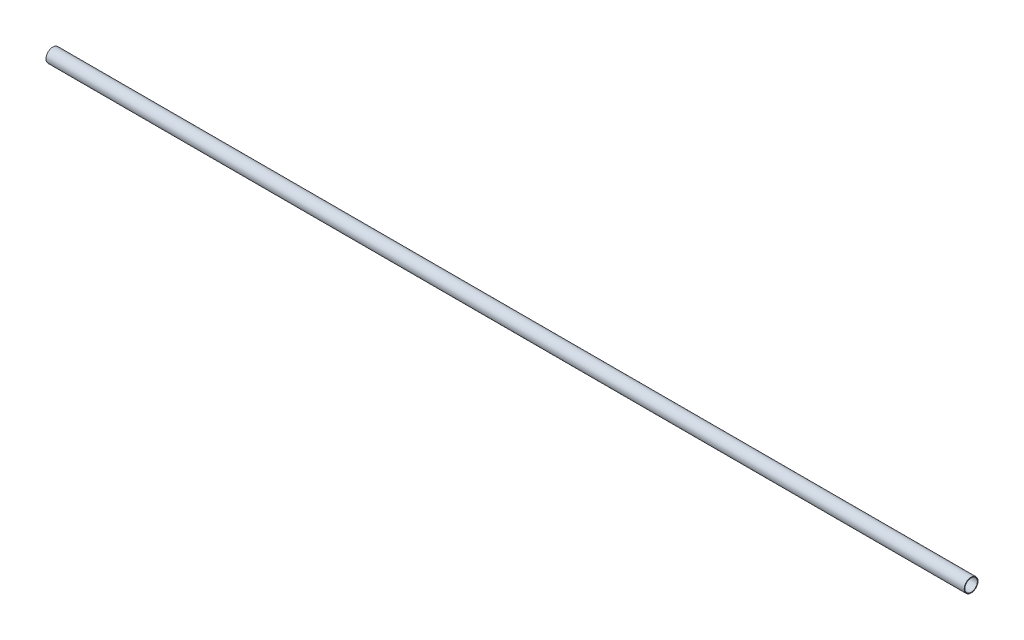
ISO-10303-21;
HEADER;
FILE_DESCRIPTION(('STEP AP214'),'2;1');
FILE_NAME('part.step','',(''),(''),'','','');
FILE_SCHEMA(('AUTOMOTIVE_DESIGN { 1 0 10303 214 1 1 1 1 }'));
ENDSEC;
DATA;
#1=APPLICATION_CONTEXT('core data for automotive mechanical design processes');
#2=APPLICATION_PROTOCOL_DEFINITION('international standard','automotive_design',2000,#1);
#3=PRODUCT_CONTEXT('',#1,'mechanical');
#4=PRODUCT('Part','Part','',(#3));
#5=PRODUCT_RELATED_PRODUCT_CATEGORY('part','',(#4));
#6=PRODUCT_DEFINITION_FORMATION('','',#4);
#7=PRODUCT_DEFINITION_CONTEXT('part definition',#1,'design');
#8=PRODUCT_DEFINITION('design','',#6,#7);
#9=PRODUCT_DEFINITION_SHAPE('','',#8);
#10=(LENGTH_UNIT() NAMED_UNIT(*) SI_UNIT(.MILLI.,.METRE.));
#11=(NAMED_UNIT(*) PLANE_ANGLE_UNIT() SI_UNIT($,.RADIAN.));
#12=(NAMED_UNIT(*) SI_UNIT($,.STERADIAN.) SOLID_ANGLE_UNIT());
#13=UNCERTAINTY_MEASURE_WITH_UNIT(LENGTH_MEASURE(1.E-05),#10,'distance_accuracy_value','');
#14=(GEOMETRIC_REPRESENTATION_CONTEXT(3) GLOBAL_UNCERTAINTY_ASSIGNED_CONTEXT((#13)) GLOBAL_UNIT_ASSIGNED_CONTEXT((#10,
#11,#12)) REPRESENTATION_CONTEXT('',''));
#15=CARTESIAN_POINT('',(0.,0.,0.));
#16=DIRECTION('',(0.,0.,1.));
#17=DIRECTION('',(1.,0.,0.));
#18=AXIS2_PLACEMENT_3D('',#15,#16,#17);
#19=CARTESIAN_POINT('',(0.,0.,0.));
#20=DIRECTION('',(1.,0.,0.));
#21=DIRECTION('',(0.,0.,-1.));
#22=AXIS2_PLACEMENT_3D('',#19,#20,#21);
#23=CYLINDRICAL_SURFACE('',#22,33.9);
#24=CARTESIAN_POINT('',(0.,0.,0.));
#25=DIRECTION('',(1.,0.,0.));
#26=DIRECTION('',(0.,0.,-1.));
#27=AXIS2_PLACEMENT_3D('',#24,#25,#26);
#28=CIRCLE('',#27,33.9);
#29=CARTESIAN_POINT('',(0.,0.,-33.9));
#30=VERTEX_POINT('',#29);
#31=EDGE_CURVE('E16',#30,#30,#28,.T.);
#32=ORIENTED_EDGE('',*,*,#31,.F.);
#33=EDGE_LOOP('',(#32));
#34=FACE_BOUND('',#33,.T.);
#35=CARTESIAN_POINT('',(5000.,0.,0.));
#36=DIRECTION('',(1.,0.,0.));
#37=DIRECTION('',(0.,0.,-1.));
#38=AXIS2_PLACEMENT_3D('',#35,#36,#37);
#39=CIRCLE('',#38,33.9);
#40=CARTESIAN_POINT('',(5000.,0.,-33.9));
#41=VERTEX_POINT('',#40);
#42=EDGE_CURVE('E25',#41,#41,#39,.F.);
#43=ORIENTED_EDGE('',*,*,#42,.F.);
#44=EDGE_LOOP('',(#43));
#45=FACE_BOUND('',#44,.T.);
#46=ADVANCED_FACE('F13',(#34,#45),#23,.F.);
#47=CARTESIAN_POINT('',(0.,-37.9500021082962,-37.5));
#48=DIRECTION('',(-1.,0.,0.));
#49=DIRECTION('',(0.,0.,1.));
#50=AXIS2_PLACEMENT_3D('',#47,#48,#49);
#51=PLANE('',#50);
#52=ORIENTED_EDGE('',*,*,#31,.T.);
#53=EDGE_LOOP('',(#52));
#54=FACE_BOUND('',#53,.T.);
#55=CARTESIAN_POINT('',(0.,0.,0.));
#56=DIRECTION('',(1.,0.,0.));
#57=DIRECTION('',(0.,0.,-1.));
#58=AXIS2_PLACEMENT_3D('',#55,#56,#57);
#59=CIRCLE('',#58,37.5);
#60=CARTESIAN_POINT('',(0.,0.,-37.5));
#61=VERTEX_POINT('',#60);
#62=EDGE_CURVE('E20',#61,#61,#59,.T.);
#63=ORIENTED_EDGE('',*,*,#62,.F.);
#64=EDGE_LOOP('',(#63));
#65=FACE_BOUND('',#64,.T.);
#66=ADVANCED_FACE('F33',(#54,#65),#51,.T.);
#67=CARTESIAN_POINT('',(5000.,-37.9500021082962,37.5));
#68=DIRECTION('',(1.,0.,0.));
#69=DIRECTION('',(0.,0.,-1.));
#70=AXIS2_PLACEMENT_3D('',#67,#68,#69);
#71=PLANE('',#70);
#72=ORIENTED_EDGE('',*,*,#42,.T.);
#73=EDGE_LOOP('',(#72));
#74=FACE_BOUND('',#73,.T.);
#75=CARTESIAN_POINT('',(5000.,0.,0.));
#76=DIRECTION('',(1.,0.,0.));
#77=DIRECTION('',(0.,0.,-1.));
#78=AXIS2_PLACEMENT_3D('',#75,#76,#77);
#79=CIRCLE('',#78,37.5);
#80=CARTESIAN_POINT('',(5000.,0.,-37.5));
#81=VERTEX_POINT('',#80);
#82=EDGE_CURVE('E8',#81,#81,#79,.F.);
#83=ORIENTED_EDGE('',*,*,#82,.F.);
#84=EDGE_LOOP('',(#83));
#85=FACE_BOUND('',#84,.T.);
#86=ADVANCED_FACE('F42',(#74,#85),#71,.T.);
#87=CARTESIAN_POINT('',(5000.,0.,0.));
#88=DIRECTION('',(1.,0.,0.));
#89=DIRECTION('',(0.,0.,-1.));
#90=AXIS2_PLACEMENT_3D('',#87,#88,#89);
#91=CYLINDRICAL_SURFACE('',#90,37.5);
#92=ORIENTED_EDGE('',*,*,#62,.T.);
#93=EDGE_LOOP('',(#92));
#94=FACE_BOUND('',#93,.T.);
#95=ORIENTED_EDGE('',*,*,#82,.T.);
#96=EDGE_LOOP('',(#95));
#97=FACE_BOUND('',#96,.T.);
#98=ADVANCED_FACE('F43',(#94,#97),#91,.T.);
#99=CLOSED_SHELL('',(#46,#66,#86,#98));
#100=MANIFOLD_SOLID_BREP('B1',#99);
#101=ADVANCED_BREP_SHAPE_REPRESENTATION('',(#18,#100),#14);
#102=SHAPE_DEFINITION_REPRESENTATION(#9,#101);
ENDSEC;
END-ISO-10303-21;
